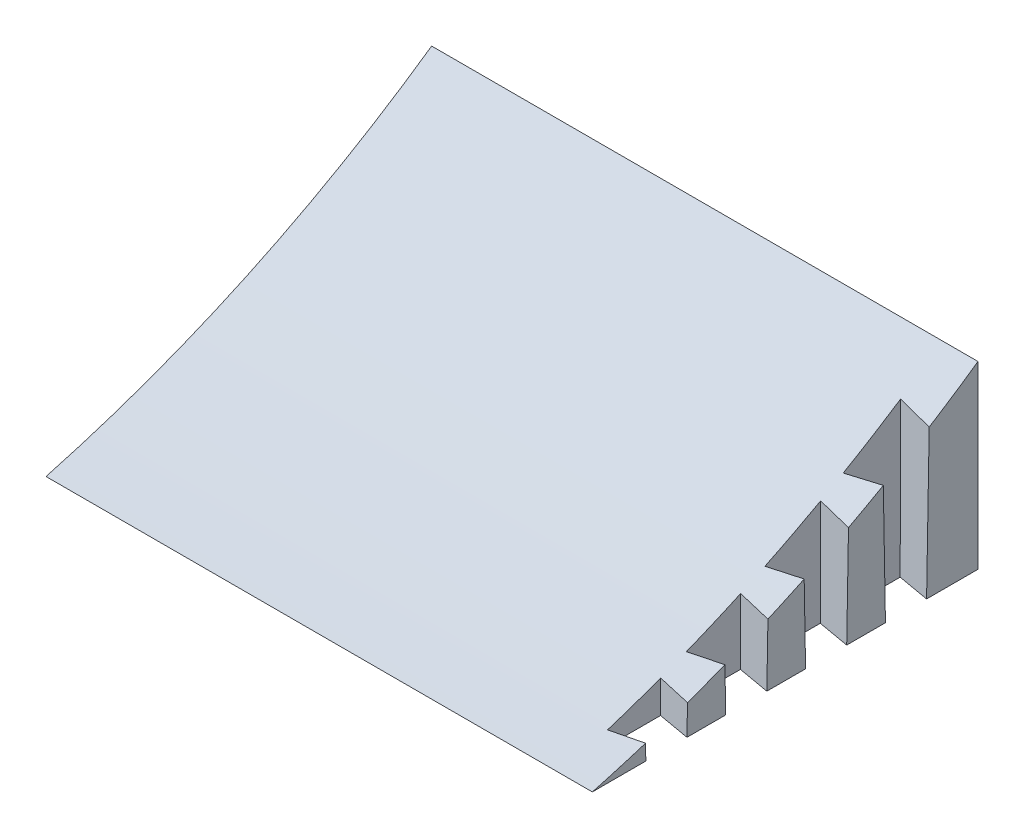
ISO-10303-21;
HEADER;
FILE_DESCRIPTION(('STEP AP214'),'2;1');
FILE_NAME('part.step','',(''),(''),'','','');
FILE_SCHEMA(('AUTOMOTIVE_DESIGN { 1 0 10303 214 1 1 1 1 }'));
ENDSEC;
DATA;
#1=APPLICATION_CONTEXT('core data for automotive mechanical design processes');
#2=APPLICATION_PROTOCOL_DEFINITION('international standard','automotive_design',2000,#1);
#3=PRODUCT_CONTEXT('',#1,'mechanical');
#4=PRODUCT('Part','Part','',(#3));
#5=PRODUCT_RELATED_PRODUCT_CATEGORY('part','',(#4));
#6=PRODUCT_DEFINITION_FORMATION('','',#4);
#7=PRODUCT_DEFINITION_CONTEXT('part definition',#1,'design');
#8=PRODUCT_DEFINITION('design','',#6,#7);
#9=PRODUCT_DEFINITION_SHAPE('','',#8);
#10=(LENGTH_UNIT() NAMED_UNIT(*) SI_UNIT(.MILLI.,.METRE.));
#11=(NAMED_UNIT(*) PLANE_ANGLE_UNIT() SI_UNIT($,.RADIAN.));
#12=(NAMED_UNIT(*) SI_UNIT($,.STERADIAN.) SOLID_ANGLE_UNIT());
#13=UNCERTAINTY_MEASURE_WITH_UNIT(LENGTH_MEASURE(1.E-05),#10,'distance_accuracy_value','');
#14=(GEOMETRIC_REPRESENTATION_CONTEXT(3) GLOBAL_UNCERTAINTY_ASSIGNED_CONTEXT((#13)) GLOBAL_UNIT_ASSIGNED_CONTEXT((#10,
#11,#12)) REPRESENTATION_CONTEXT('',''));
#15=CARTESIAN_POINT('',(0.,0.,0.));
#16=DIRECTION('',(0.,0.,1.));
#17=DIRECTION('',(1.,0.,0.));
#18=AXIS2_PLACEMENT_3D('',#15,#16,#17);
#19=CARTESIAN_POINT('',(134.9375,294.29273435255,79.3399426978569));
#20=DIRECTION('',(1.,0.,0.));
#21=DIRECTION('',(0.,0.,-1.));
#22=AXIS2_PLACEMENT_3D('',#19,#20,#21);
#23=PLANE('',#22);
#24=DIRECTION('',(0.,0.999842960930802,-0.0177215540268519));
#25=VECTOR('',#24,1.);
#26=CARTESIAN_POINT('',(134.9375,291.331819865992,-87.7136634824032));
#27=LINE('',#26,#25);
#28=CARTESIAN_POINT('',(134.9375,0.,-82.55));
#29=VERTEX_POINT('',#28);
#30=CARTESIAN_POINT('',(134.9375,36.4456567668093,-83.1959751187685));
#31=VERTEX_POINT('',#30);
#32=EDGE_CURVE('E11',#29,#31,#27,.T.);
#33=ORIENTED_EDGE('',*,*,#32,.F.);
#34=DIRECTION('',(0.,0.,-1.));
#35=VECTOR('',#34,1.);
#36=CARTESIAN_POINT('',(134.9375,0.,0.));
#37=LINE('',#36,#35);
#38=CARTESIAN_POINT('',(134.9375,0.,-95.25));
#39=VERTEX_POINT('',#38);
#40=EDGE_CURVE('E217',#29,#39,#37,.T.);
#41=ORIENTED_EDGE('',*,*,#40,.T.);
#42=DIRECTION('',(0.,1.,0.));
#43=VECTOR('',#42,1.);
#44=CARTESIAN_POINT('',(134.9375,0.,-95.25));
#45=LINE('',#44,#43);
#46=CARTESIAN_POINT('',(134.9375,44.45,-95.25));
#47=VERTEX_POINT('',#46);
#48=EDGE_CURVE('E226',#39,#47,#45,.T.);
#49=ORIENTED_EDGE('',*,*,#48,.T.);
#50=CARTESIAN_POINT('',(134.9375,294.29273435255,79.3399426978569));
#51=DIRECTION('',(-1.,0.,0.));
#52=DIRECTION('',(0.,0.,-1.));
#53=AXIS2_PLACEMENT_3D('',#50,#51,#52);
#54=CIRCLE('',#53,304.8);
#55=EDGE_CURVE('E221',#47,#31,#54,.T.);
#56=ORIENTED_EDGE('',*,*,#55,.T.);
#57=EDGE_LOOP('',(#33,#41,#49,#56));
#58=FACE_BOUND('',#57,.T.);
#59=ADVANCED_FACE('F35',(#58),#23,.T.);
#60=DIRECTION('',(0.,-0.999842960930802,-0.0177215540268519));
#61=VECTOR('',#60,1.);
#62=CARTESIAN_POINT('',(134.9375,296.888778812203,-67.1278431020922));
#63=LINE('',#62,#61);
#64=CARTESIAN_POINT('',(134.9375,29.6416063292887,-71.864622167147));
#65=VERTEX_POINT('',#64);
#66=CARTESIAN_POINT('',(134.9375,0.,-72.39));
#67=VERTEX_POINT('',#66);
#68=EDGE_CURVE('E43',#65,#67,#63,.T.);
#69=ORIENTED_EDGE('',*,*,#68,.F.);
#70=CARTESIAN_POINT('',(134.9375,24.9099125980556,-63.2641783631631));
#71=VERTEX_POINT('',#70);
#72=EDGE_CURVE('E268',#65,#71,#54,.T.);
#73=ORIENTED_EDGE('',*,*,#72,.T.);
#74=DIRECTION('',(0.,0.999842960930802,-0.0177215540268519));
#75=VECTOR('',#74,1.);
#76=CARTESIAN_POINT('',(134.9375,291.681363968762,-67.9925255866976));
#77=LINE('',#76,#75);
#78=CARTESIAN_POINT('',(134.9375,0.,-62.8226666666667));
#79=VERTEX_POINT('',#78);
#80=EDGE_CURVE('E202',#79,#71,#77,.T.);
#81=ORIENTED_EDGE('',*,*,#80,.F.);
#82=EDGE_CURVE('E208',#79,#67,#37,.T.);
#83=ORIENTED_EDGE('',*,*,#82,.T.);
#84=EDGE_LOOP('',(#69,#73,#81,#83));
#85=FACE_BOUND('',#84,.T.);
#86=ADVANCED_FACE('F215',(#85),#23,.T.);
#87=DIRECTION('',(0.,-0.999842960930802,-0.0177215540268519));
#88=VECTOR('',#87,1.);
#89=CARTESIAN_POINT('',(134.9375,296.539234709433,-47.4067052063867));
#90=LINE('',#89,#88);
#91=CARTESIAN_POINT('',(134.9375,19.3945960777428,-52.3189103012663));
#92=VERTEX_POINT('',#91);
#93=CARTESIAN_POINT('',(134.9375,0.,-52.6626666666667));
#94=VERTEX_POINT('',#93);
#95=EDGE_CURVE('E257',#92,#94,#90,.T.);
#96=ORIENTED_EDGE('',*,*,#95,.F.);
#97=CARTESIAN_POINT('',(134.9375,15.2833483105824,-43.3662205560078));
#98=VERTEX_POINT('',#97);
#99=EDGE_CURVE('E273',#92,#98,#54,.T.);
#100=ORIENTED_EDGE('',*,*,#99,.T.);
#101=DIRECTION('',(0.,0.999842960930802,-0.0177215540268519));
#102=VECTOR('',#101,1.);
#103=CARTESIAN_POINT('',(134.9375,292.030908071532,-48.2713876909921));
#104=LINE('',#103,#102);
#105=CARTESIAN_POINT('',(134.9375,0.,-43.0953333333333));
#106=VERTEX_POINT('',#105);
#107=EDGE_CURVE('E255',#106,#98,#104,.T.);
#108=ORIENTED_EDGE('',*,*,#107,.F.);
#109=EDGE_CURVE('E216',#106,#94,#37,.T.);
#110=ORIENTED_EDGE('',*,*,#109,.T.);
#111=EDGE_LOOP('',(#96,#100,#108,#110));
#112=FACE_BOUND('',#111,.T.);
#113=ADVANCED_FACE('F431',(#112),#23,.T.);
#114=DIRECTION('',(0.,-0.999842960930802,-0.0177215540268519));
#115=VECTOR('',#114,1.);
#116=CARTESIAN_POINT('',(134.9375,296.189690606663,-27.6855673106811));
#117=LINE('',#116,#115);
#118=CARTESIAN_POINT('',(134.9375,10.8488353393792,-32.7430449149439));
#119=VERTEX_POINT('',#118);
#120=CARTESIAN_POINT('',(134.9375,0.,-32.9353333333333));
#121=VERTEX_POINT('',#120);
#122=EDGE_CURVE('E253',#119,#121,#117,.T.);
#123=ORIENTED_EDGE('',*,*,#122,.F.);
#124=CARTESIAN_POINT('',(134.9375,7.36541776200195,-23.4985471498026));
#125=VERTEX_POINT('',#124);
#126=EDGE_CURVE('E276',#119,#125,#54,.T.);
#127=ORIENTED_EDGE('',*,*,#126,.T.);
#128=DIRECTION('',(0.,0.999842960930802,-0.0177215540268519));
#129=VECTOR('',#128,1.);
#130=CARTESIAN_POINT('',(134.9375,292.380452174302,-28.5502497952865));
#131=LINE('',#130,#129);
#132=CARTESIAN_POINT('',(134.9375,0.,-23.368));
#133=VERTEX_POINT('',#132);
#134=EDGE_CURVE('E251',#133,#125,#131,.T.);
#135=ORIENTED_EDGE('',*,*,#134,.F.);
#136=EDGE_CURVE('E220',#133,#121,#37,.T.);
#137=ORIENTED_EDGE('',*,*,#136,.T.);
#138=EDGE_LOOP('',(#123,#127,#135,#137));
#139=FACE_BOUND('',#138,.T.);
#140=ADVANCED_FACE('F434',(#139),#23,.T.);
#141=CARTESIAN_POINT('',(134.9375,294.29273435255,79.3399426978569));
#142=DIRECTION('',(-1.,0.,0.));
#143=DIRECTION('',(0.,0.,1.));
#144=AXIS2_PLACEMENT_3D('',#141,#142,#143);
#145=CYLINDRICAL_SURFACE('',#144,304.8);
#146=CARTESIAN_POINT('',(121.877820511967,294.29273435255,79.3399426978569));
#147=DIRECTION('',(-0.999847695156391,-0.0174524064372835,0.));
#148=DIRECTION('',(-0.0174524064372835,0.999847695156391,0.));
#149=AXIS2_PLACEMENT_3D('',#146,#147,#148);
#150=ELLIPSE('',#149,304.846429587783,304.8);
#151=CARTESIAN_POINT('',(126.511897262519,28.8066551194369,-70.3937600327877));
#152=VERTEX_POINT('',#151);
#153=CARTESIAN_POINT('',(126.361619512473,37.4160616535716,-84.7253340157175));
#154=VERTEX_POINT('',#153);
#155=EDGE_CURVE('E372',#152,#154,#150,.F.);
#156=ORIENTED_EDGE('',*,*,#155,.T.);
#157=CARTESIAN_POINT('',(1082.64320990519,294.29273435255,79.3399426978569));
#158=DIRECTION('',(0.173621730208385,-0.0174524064372835,-0.984657762021401));
#159=DIRECTION('',(-0.984812416046552,-0.0030768468721234,-0.17359446481348));
#160=AXIS2_PLACEMENT_3D('',#157,#158,#159);
#161=ELLIPSE('',#160,1755.54062060188,304.8);
#162=EDGE_CURVE('E362',#154,#31,#161,.F.);
#163=ORIENTED_EDGE('',*,*,#162,.T.);
#164=ORIENTED_EDGE('',*,*,#55,.F.);
#165=DIRECTION('',(-1.,0.,0.));
#166=VECTOR('',#165,1.);
#167=CARTESIAN_POINT('',(134.9375,44.45,-95.25));
#168=LINE('',#167,#166);
#169=CARTESIAN_POINT('',(0.,44.45,-95.25));
#170=VERTEX_POINT('',#169);
#171=EDGE_CURVE('E229',#47,#170,#168,.T.);
#172=ORIENTED_EDGE('',*,*,#171,.T.);
#173=CARTESIAN_POINT('',(0.,294.29273435255,79.3399426978569));
#174=DIRECTION('',(-1.,0.,0.));
#175=DIRECTION('',(0.,0.,-1.));
#176=AXIS2_PLACEMENT_3D('',#173,#174,#175);
#177=CIRCLE('',#176,304.8);
#178=CARTESIAN_POINT('',(0.,0.,0.));
#179=VERTEX_POINT('',#178);
#180=EDGE_CURVE('E230',#170,#179,#177,.T.);
#181=ORIENTED_EDGE('',*,*,#180,.T.);
#182=DIRECTION('',(-1.,0.,0.));
#183=VECTOR('',#182,1.);
#184=CARTESIAN_POINT('',(134.9375,0.,0.));
#185=LINE('',#184,#183);
#186=CARTESIAN_POINT('',(134.9375,0.,0.));
#187=VERTEX_POINT('',#186);
#188=EDGE_CURVE('E246',#187,#179,#185,.T.);
#189=ORIENTED_EDGE('',*,*,#188,.F.);
#190=CARTESIAN_POINT('',(134.9375,3.86102038828029,-13.1395659717742));
#191=VERTEX_POINT('',#190);
#192=EDGE_CURVE('E240',#191,#187,#54,.T.);
#193=ORIENTED_EDGE('',*,*,#192,.F.);
#194=CARTESIAN_POINT('',(-360.345743761525,294.29273435255,79.3399426978569));
#195=DIRECTION('',(0.173621730208383,-0.0174524064372835,0.984657762021402));
#196=DIRECTION('',(-0.984812416046552,-0.00307684687212337,0.173594464813479));
#197=AXIS2_PLACEMENT_3D('',#194,#195,#196);
#198=ELLIPSE('',#197,1755.54062060189,304.8);
#199=CARTESIAN_POINT('',(126.955039745881,3.41903925068536,-11.7398766793651));
#200=VERTEX_POINT('',#199);
#201=EDGE_CURVE('E50',#191,#200,#198,.F.);
#202=ORIENTED_EDGE('',*,*,#201,.T.);
#203=CARTESIAN_POINT('',(121.877820511967,294.29273435255,79.3399426978569));
#204=DIRECTION('',(-0.999847695156391,-0.0174524064372835,0.));
#205=DIRECTION('',(-0.0174524064372835,0.999847695156391,0.));
#206=AXIS2_PLACEMENT_3D('',#203,#204,#205);
#207=ELLIPSE('',#206,304.846429587783,304.8);
#208=CARTESIAN_POINT('',(126.877136224637,7.88212899362856,-24.9289651219526));
#209=VERTEX_POINT('',#208);
#210=EDGE_CURVE('E365',#200,#209,#207,.F.);
#211=ORIENTED_EDGE('',*,*,#210,.T.);
#212=CARTESIAN_POINT('',(747.00540925657,294.29273435255,79.3399426978569));
#213=DIRECTION('',(0.173621730208385,-0.0174524064372835,-0.984657762021401));
#214=DIRECTION('',(-0.984812416046552,-0.0030768468721234,-0.17359446481348));
#215=AXIS2_PLACEMENT_3D('',#212,#213,#214);
#216=ELLIPSE('',#215,1755.54062060188,304.8);
#217=EDGE_CURVE('E353',#209,#125,#216,.F.);
#218=ORIENTED_EDGE('',*,*,#217,.T.);
#219=ORIENTED_EDGE('',*,*,#126,.F.);
#220=CARTESIAN_POINT('',(-472.2250106444,294.29273435255,79.3399426978569));
#221=DIRECTION('',(0.173621730208383,-0.0174524064372835,0.984657762021402));
#222=DIRECTION('',(-0.984812416046552,-0.00307684687212337,0.173594464813479));
#223=AXIS2_PLACEMENT_3D('',#220,#221,#222);
#224=ELLIPSE('',#223,1755.5406206019,304.8);
#225=CARTESIAN_POINT('',(126.835073661376,10.2918916289684,-31.3242400005002));
#226=VERTEX_POINT('',#225);
#227=EDGE_CURVE('E58',#119,#226,#224,.F.);
#228=ORIENTED_EDGE('',*,*,#227,.T.);
#229=CARTESIAN_POINT('',(121.877820511967,294.29273435255,79.3399426978569));
#230=DIRECTION('',(-0.999847695156391,-0.0174524064372835,0.));
#231=DIRECTION('',(-0.0174524064372835,0.999847695156391,0.));
#232=AXIS2_PLACEMENT_3D('',#229,#230,#231);
#233=ELLIPSE('',#232,304.846429587783,304.8);
#234=CARTESIAN_POINT('',(126.736679580615,15.928884740479,-44.8236881654038));
#235=VERTEX_POINT('',#234);
#236=EDGE_CURVE('E368',#226,#235,#233,.F.);
#237=ORIENTED_EDGE('',*,*,#236,.T.);
#238=CARTESIAN_POINT('',(858.884676139444,294.29273435255,79.3399426978569));
#239=DIRECTION('',(0.173621730208385,-0.0174524064372835,-0.984657762021401));
#240=DIRECTION('',(-0.984812416046552,-0.0030768468721234,-0.17359446481348));
#241=AXIS2_PLACEMENT_3D('',#238,#239,#240);
#242=ELLIPSE('',#241,1755.54062060188,304.8);
#243=EDGE_CURVE('E357',#235,#98,#242,.F.);
#244=ORIENTED_EDGE('',*,*,#243,.T.);
#245=ORIENTED_EDGE('',*,*,#99,.F.);
#246=CARTESIAN_POINT('',(-584.104277527275,294.29273435255,79.3399426978569));
#247=DIRECTION('',(0.173621730208383,-0.0174524064372835,0.984657762021402));
#248=DIRECTION('',(-0.984812416046552,-0.00307684687212337,0.173594464813479));
#249=AXIS2_PLACEMENT_3D('',#246,#247,#248);
#250=ELLIPSE('',#249,1755.5406206019,304.8);
#251=CARTESIAN_POINT('',(126.688162798197,18.7084093436497,-50.8764917848485));
#252=VERTEX_POINT('',#251);
#253=EDGE_CURVE('E271',#92,#252,#250,.F.);
#254=ORIENTED_EDGE('',*,*,#253,.T.);
#255=CARTESIAN_POINT('',(121.877820511967,294.29273435255,79.3399426978569));
#256=DIRECTION('',(-0.999847695156391,-0.0174524064372835,0.));
#257=DIRECTION('',(-0.0174524064372835,0.999847695156391,0.));
#258=AXIS2_PLACEMENT_3D('',#255,#256,#257);
#259=ELLIPSE('',#258,304.846429587783,304.8);
#260=CARTESIAN_POINT('',(126.566053071268,25.704070914168,-64.7543662542434));
#261=VERTEX_POINT('',#260);
#262=EDGE_CURVE('E270',#252,#261,#259,.F.);
#263=ORIENTED_EDGE('',*,*,#262,.T.);
#264=CARTESIAN_POINT('',(970.763943022317,294.29273435255,79.3399426978569));
#265=DIRECTION('',(0.173621730208385,-0.0174524064372835,-0.984657762021401));
#266=DIRECTION('',(-0.984812416046552,-0.0030768468721234,-0.17359446481348));
#267=AXIS2_PLACEMENT_3D('',#264,#265,#266);
#268=ELLIPSE('',#267,1755.54062060188,304.8);
#269=EDGE_CURVE('E262',#261,#71,#268,.F.);
#270=ORIENTED_EDGE('',*,*,#269,.T.);
#271=ORIENTED_EDGE('',*,*,#72,.F.);
#272=CARTESIAN_POINT('',(-695.98354441015,294.29273435255,79.3399426978569));
#273=DIRECTION('',(0.173621730208383,-0.0174524064372835,0.984657762021402));
#274=DIRECTION('',(-0.984812416046552,-0.00307684687212337,0.173594464813479));
#275=AXIS2_PLACEMENT_3D('',#272,#273,#274);
#276=ELLIPSE('',#275,1755.5406206019,304.8);
#277=EDGE_CURVE('E197',#65,#152,#276,.F.);
#278=ORIENTED_EDGE('',*,*,#277,.T.);
#279=EDGE_LOOP('',(#156,#163,#164,#172,#181,#189,#193,#202,#211,#218,#219,#228,#237,#244,#245,
#254,#263,#270,#271,#278));
#280=FACE_BOUND('',#279,.T.);
#281=ADVANCED_FACE('F37',(#280),#145,.F.);
#282=CARTESIAN_POINT('',(134.9375,0.,0.));
#283=DIRECTION('',(0.,1.,0.));
#284=DIRECTION('',(0.,0.,1.));
#285=AXIS2_PLACEMENT_3D('',#282,#283,#284);
#286=PLANE('',#285);
#287=ORIENTED_EDGE('',*,*,#40,.F.);
#288=DIRECTION('',(0.984807753012209,0.,0.173648177666927));
#289=VECTOR('',#288,1.);
#290=CARTESIAN_POINT('',(134.9375,0.,-82.55));
#291=LINE('',#290,#289);
#292=CARTESIAN_POINT('',(127.014719297994,0.,-83.947));
#293=VERTEX_POINT('',#292);
#294=EDGE_CURVE('E311',#293,#29,#291,.T.);
#295=ORIENTED_EDGE('',*,*,#294,.F.);
#296=DIRECTION('',(0.,0.,-1.));
#297=VECTOR('',#296,1.);
#298=CARTESIAN_POINT('',(127.014719297994,0.,-83.947));
#299=LINE('',#298,#297);
#300=CARTESIAN_POINT('',(127.014719297994,0.,-70.993));
#301=VERTEX_POINT('',#300);
#302=EDGE_CURVE('E211',#301,#293,#299,.T.);
#303=ORIENTED_EDGE('',*,*,#302,.F.);
#304=DIRECTION('',(-0.984807753012209,0.,0.173648177666926));
#305=VECTOR('',#304,1.);
#306=CARTESIAN_POINT('',(127.014719297994,0.,-70.993));
#307=LINE('',#306,#305);
#308=EDGE_CURVE('E194',#67,#301,#307,.T.);
#309=ORIENTED_EDGE('',*,*,#308,.F.);
#310=ORIENTED_EDGE('',*,*,#82,.F.);
#311=DIRECTION('',(0.984807753012209,0.,0.173648177666927));
#312=VECTOR('',#311,1.);
#313=CARTESIAN_POINT('',(134.9375,0.,-62.8226666666667));
#314=LINE('',#313,#312);
#315=CARTESIAN_POINT('',(127.014719297994,0.,-64.2196666666667));
#316=VERTEX_POINT('',#315);
#317=EDGE_CURVE('E264',#316,#79,#314,.T.);
#318=ORIENTED_EDGE('',*,*,#317,.F.);
#319=DIRECTION('',(0.,0.,-1.));
#320=VECTOR('',#319,1.);
#321=CARTESIAN_POINT('',(127.014719297994,0.,-64.2196666666667));
#322=LINE('',#321,#320);
#323=CARTESIAN_POINT('',(127.014719297994,0.,-51.2656666666667));
#324=VERTEX_POINT('',#323);
#325=EDGE_CURVE('E323',#324,#316,#322,.T.);
#326=ORIENTED_EDGE('',*,*,#325,.F.);
#327=DIRECTION('',(-0.984807753012209,0.,0.173648177666926));
#328=VECTOR('',#327,1.);
#329=CARTESIAN_POINT('',(127.014719297994,0.,-51.2656666666667));
#330=LINE('',#329,#328);
#331=EDGE_CURVE('E320',#94,#324,#330,.T.);
#332=ORIENTED_EDGE('',*,*,#331,.F.);
#333=ORIENTED_EDGE('',*,*,#109,.F.);
#334=DIRECTION('',(0.984807753012209,0.,0.173648177666927));
#335=VECTOR('',#334,1.);
#336=CARTESIAN_POINT('',(134.9375,0.,-43.0953333333333));
#337=LINE('',#336,#335);
#338=CARTESIAN_POINT('',(127.014719297994,0.,-44.4923333333333));
#339=VERTEX_POINT('',#338);
#340=EDGE_CURVE('E338',#339,#106,#337,.T.);
#341=ORIENTED_EDGE('',*,*,#340,.F.);
#342=DIRECTION('',(0.,0.,-1.));
#343=VECTOR('',#342,1.);
#344=CARTESIAN_POINT('',(127.014719297994,0.,-44.4923333333333));
#345=LINE('',#344,#343);
#346=CARTESIAN_POINT('',(127.014719297994,0.,-31.5383333333333));
#347=VERTEX_POINT('',#346);
#348=EDGE_CURVE('E334',#347,#339,#345,.T.);
#349=ORIENTED_EDGE('',*,*,#348,.F.);
#350=DIRECTION('',(-0.984807753012209,0.,0.173648177666926));
#351=VECTOR('',#350,1.);
#352=CARTESIAN_POINT('',(127.014719297994,0.,-31.5383333333333));
#353=LINE('',#352,#351);
#354=EDGE_CURVE('E331',#121,#347,#353,.T.);
#355=ORIENTED_EDGE('',*,*,#354,.F.);
#356=ORIENTED_EDGE('',*,*,#136,.F.);
#357=DIRECTION('',(0.984807753012209,0.,0.173648177666927));
#358=VECTOR('',#357,1.);
#359=CARTESIAN_POINT('',(134.9375,0.,-23.368));
#360=LINE('',#359,#358);
#361=CARTESIAN_POINT('',(127.014719297994,0.,-24.765));
#362=VERTEX_POINT('',#361);
#363=EDGE_CURVE('E347',#362,#133,#360,.T.);
#364=ORIENTED_EDGE('',*,*,#363,.F.);
#365=DIRECTION('',(0.,0.,-1.));
#366=VECTOR('',#365,1.);
#367=CARTESIAN_POINT('',(127.014719297994,0.,-24.765));
#368=LINE('',#367,#366);
#369=CARTESIAN_POINT('',(127.014719297994,0.,-11.811));
#370=VERTEX_POINT('',#369);
#371=EDGE_CURVE('E344',#370,#362,#368,.T.);
#372=ORIENTED_EDGE('',*,*,#371,.F.);
#373=DIRECTION('',(-0.984807753012209,0.,0.173648177666926));
#374=VECTOR('',#373,1.);
#375=CARTESIAN_POINT('',(127.014719297994,0.,-11.811));
#376=LINE('',#375,#374);
#377=CARTESIAN_POINT('',(134.9375,0.,-13.208));
#378=VERTEX_POINT('',#377);
#379=EDGE_CURVE('E293',#378,#370,#376,.T.);
#380=ORIENTED_EDGE('',*,*,#379,.F.);
#381=EDGE_CURVE('E222',#187,#378,#37,.T.);
#382=ORIENTED_EDGE('',*,*,#381,.F.);
#383=ORIENTED_EDGE('',*,*,#188,.T.);
#384=DIRECTION('',(0.,0.,-1.));
#385=VECTOR('',#384,1.);
#386=CARTESIAN_POINT('',(0.,0.,0.));
#387=LINE('',#386,#385);
#388=CARTESIAN_POINT('',(0.,0.,-95.25));
#389=VERTEX_POINT('',#388);
#390=EDGE_CURVE('E233',#179,#389,#387,.T.);
#391=ORIENTED_EDGE('',*,*,#390,.T.);
#392=DIRECTION('',(-1.,0.,0.));
#393=VECTOR('',#392,1.);
#394=CARTESIAN_POINT('',(134.9375,0.,-95.25));
#395=LINE('',#394,#393);
#396=EDGE_CURVE('E243',#39,#389,#395,.T.);
#397=ORIENTED_EDGE('',*,*,#396,.F.);
#398=EDGE_LOOP('',(#287,#295,#303,#309,#310,#318,#326,#332,#333,#341,#349,#355,#356,#364,#372,
#380,#382,#383,#391,#397));
#399=FACE_BOUND('',#398,.T.);
#400=ADVANCED_FACE('F206',(#399),#286,.F.);
#401=CARTESIAN_POINT('',(134.9375,0.,-95.25));
#402=DIRECTION('',(0.,0.,1.));
#403=DIRECTION('',(1.,0.,0.));
#404=AXIS2_PLACEMENT_3D('',#401,#402,#403);
#405=PLANE('',#404);
#406=DIRECTION('',(0.,-1.,0.));
#407=VECTOR('',#406,1.);
#408=CARTESIAN_POINT('',(6.35,26.67,-95.25));
#409=LINE('',#408,#407);
#410=CARTESIAN_POINT('',(6.35,26.67,-95.25));
#411=VERTEX_POINT('',#410);
#412=CARTESIAN_POINT('',(6.35,7.62,-95.25));
#413=VERTEX_POINT('',#412);
#414=EDGE_CURVE('E381',#411,#413,#409,.T.);
#415=ORIENTED_EDGE('',*,*,#414,.F.);
#416=DIRECTION('',(-1.,0.,0.));
#417=VECTOR('',#416,1.);
#418=CARTESIAN_POINT('',(6.35,26.67,-95.25));
#419=LINE('',#418,#417);
#420=CARTESIAN_POINT('',(0.,26.67,-95.25));
#421=VERTEX_POINT('',#420);
#422=EDGE_CURVE('E234',#411,#421,#419,.T.);
#423=ORIENTED_EDGE('',*,*,#422,.T.);
#424=DIRECTION('',(0.,1.,0.));
#425=VECTOR('',#424,1.);
#426=CARTESIAN_POINT('',(0.,0.,-95.25));
#427=LINE('',#426,#425);
#428=EDGE_CURVE('E236',#421,#170,#427,.T.);
#429=ORIENTED_EDGE('',*,*,#428,.T.);
#430=ORIENTED_EDGE('',*,*,#171,.F.);
#431=ORIENTED_EDGE('',*,*,#48,.F.);
#432=ORIENTED_EDGE('',*,*,#396,.T.);
#433=CARTESIAN_POINT('',(0.,7.62,-95.25));
#434=VERTEX_POINT('',#433);
#435=EDGE_CURVE('E237',#389,#434,#427,.T.);
#436=ORIENTED_EDGE('',*,*,#435,.T.);
#437=DIRECTION('',(-1.,0.,0.));
#438=VECTOR('',#437,1.);
#439=CARTESIAN_POINT('',(6.35,7.62,-95.25));
#440=LINE('',#439,#438);
#441=EDGE_CURVE('E394',#413,#434,#440,.T.);
#442=ORIENTED_EDGE('',*,*,#441,.F.);
#443=EDGE_LOOP('',(#415,#423,#429,#430,#431,#432,#436,#442));
#444=FACE_BOUND('',#443,.T.);
#445=ADVANCED_FACE('F307',(#444),#405,.F.);
#446=DIRECTION('',(0.,-0.999842960930802,-0.0177215540268519));
#447=VECTOR('',#446,1.);
#448=CARTESIAN_POINT('',(134.9375,295.840146503892,-7.96442941497553));
#449=LINE('',#448,#447);
#450=EDGE_CURVE('E249',#191,#378,#449,.T.);
#451=ORIENTED_EDGE('',*,*,#450,.F.);
#452=ORIENTED_EDGE('',*,*,#192,.T.);
#453=ORIENTED_EDGE('',*,*,#381,.T.);
#454=EDGE_LOOP('',(#451,#452,#453));
#455=FACE_BOUND('',#454,.T.);
#456=ADVANCED_FACE('F288',(#455),#23,.T.);
#457=CARTESIAN_POINT('',(0.,294.29273435255,79.3399426978569));
#458=DIRECTION('',(1.,0.,0.));
#459=DIRECTION('',(0.,0.,-1.));
#460=AXIS2_PLACEMENT_3D('',#457,#458,#459);
#461=PLANE('',#460);
#462=ORIENTED_EDGE('',*,*,#428,.F.);
#463=DIRECTION('',(0.,0.,-1.));
#464=VECTOR('',#463,1.);
#465=CARTESIAN_POINT('',(0.,26.67,-95.25));
#466=LINE('',#465,#464);
#467=CARTESIAN_POINT('',(0.,26.67,-69.85));
#468=VERTEX_POINT('',#467);
#469=EDGE_CURVE('E385',#468,#421,#466,.T.);
#470=ORIENTED_EDGE('',*,*,#469,.F.);
#471=DIRECTION('',(0.,1.,0.));
#472=VECTOR('',#471,1.);
#473=CARTESIAN_POINT('',(0.,26.67,-69.85));
#474=LINE('',#473,#472);
#475=CARTESIAN_POINT('',(0.,7.62,-69.85));
#476=VERTEX_POINT('',#475);
#477=EDGE_CURVE('E397',#476,#468,#474,.T.);
#478=ORIENTED_EDGE('',*,*,#477,.F.);
#479=DIRECTION('',(0.,0.,1.));
#480=VECTOR('',#479,1.);
#481=CARTESIAN_POINT('',(0.,7.62,-95.25));
#482=LINE('',#481,#480);
#483=EDGE_CURVE('E378',#434,#476,#482,.T.);
#484=ORIENTED_EDGE('',*,*,#483,.F.);
#485=ORIENTED_EDGE('',*,*,#435,.F.);
#486=ORIENTED_EDGE('',*,*,#390,.F.);
#487=ORIENTED_EDGE('',*,*,#180,.F.);
#488=EDGE_LOOP('',(#462,#470,#478,#484,#485,#486,#487));
#489=FACE_BOUND('',#488,.T.);
#490=ADVANCED_FACE('F299',(#489),#461,.F.);
#491=CARTESIAN_POINT('',(6.35,26.67,-95.25));
#492=DIRECTION('',(0.,1.,0.));
#493=DIRECTION('',(0.,0.,1.));
#494=AXIS2_PLACEMENT_3D('',#491,#492,#493);
#495=PLANE('',#494);
#496=ORIENTED_EDGE('',*,*,#469,.T.);
#497=ORIENTED_EDGE('',*,*,#422,.F.);
#498=DIRECTION('',(0.,0.,-1.));
#499=VECTOR('',#498,1.);
#500=CARTESIAN_POINT('',(6.35,26.67,-95.25));
#501=LINE('',#500,#499);
#502=CARTESIAN_POINT('',(6.35,26.67,-69.85));
#503=VERTEX_POINT('',#502);
#504=EDGE_CURVE('E391',#503,#411,#501,.T.);
#505=ORIENTED_EDGE('',*,*,#504,.F.);
#506=DIRECTION('',(-1.,0.,0.));
#507=VECTOR('',#506,1.);
#508=CARTESIAN_POINT('',(6.35,26.67,-69.85));
#509=LINE('',#508,#507);
#510=EDGE_CURVE('E403',#503,#468,#509,.T.);
#511=ORIENTED_EDGE('',*,*,#510,.T.);
#512=EDGE_LOOP('',(#496,#497,#505,#511));
#513=FACE_BOUND('',#512,.T.);
#514=ADVANCED_FACE('F416',(#513),#495,.F.);
#515=CARTESIAN_POINT('',(6.35,26.67,-69.85));
#516=DIRECTION('',(0.,0.,1.));
#517=DIRECTION('',(1.,0.,0.));
#518=AXIS2_PLACEMENT_3D('',#515,#516,#517);
#519=PLANE('',#518);
#520=ORIENTED_EDGE('',*,*,#477,.T.);
#521=ORIENTED_EDGE('',*,*,#510,.F.);
#522=DIRECTION('',(0.,1.,0.));
#523=VECTOR('',#522,1.);
#524=CARTESIAN_POINT('',(6.35,26.67,-69.85));
#525=LINE('',#524,#523);
#526=CARTESIAN_POINT('',(6.35,7.62,-69.85));
#527=VERTEX_POINT('',#526);
#528=EDGE_CURVE('E388',#527,#503,#525,.T.);
#529=ORIENTED_EDGE('',*,*,#528,.F.);
#530=DIRECTION('',(-1.,0.,0.));
#531=VECTOR('',#530,1.);
#532=CARTESIAN_POINT('',(6.35,7.62,-69.85));
#533=LINE('',#532,#531);
#534=EDGE_CURVE('E405',#527,#476,#533,.T.);
#535=ORIENTED_EDGE('',*,*,#534,.T.);
#536=EDGE_LOOP('',(#520,#521,#529,#535));
#537=FACE_BOUND('',#536,.T.);
#538=ADVANCED_FACE('F410',(#537),#519,.F.);
#539=CARTESIAN_POINT('',(6.35,7.62,-95.25));
#540=DIRECTION('',(0.,-1.,0.));
#541=DIRECTION('',(0.,0.,-1.));
#542=AXIS2_PLACEMENT_3D('',#539,#540,#541);
#543=PLANE('',#542);
#544=ORIENTED_EDGE('',*,*,#483,.T.);
#545=ORIENTED_EDGE('',*,*,#534,.F.);
#546=DIRECTION('',(0.,0.,1.));
#547=VECTOR('',#546,1.);
#548=CARTESIAN_POINT('',(6.35,7.62,-95.25));
#549=LINE('',#548,#547);
#550=EDGE_CURVE('E384',#413,#527,#549,.T.);
#551=ORIENTED_EDGE('',*,*,#550,.F.);
#552=ORIENTED_EDGE('',*,*,#441,.T.);
#553=EDGE_LOOP('',(#544,#545,#551,#552));
#554=FACE_BOUND('',#553,.T.);
#555=ADVANCED_FACE('F407',(#554),#543,.F.);
#556=CARTESIAN_POINT('',(6.35,0.,0.));
#557=DIRECTION('',(-1.,0.,0.));
#558=DIRECTION('',(0.,0.,1.));
#559=AXIS2_PLACEMENT_3D('',#556,#557,#558);
#560=PLANE('',#559);
#561=CARTESIAN_POINT('',(6.35,17.145,-82.55));
#562=DIRECTION('',(-1.,0.,0.));
#563=DIRECTION('',(0.,0.,1.));
#564=AXIS2_PLACEMENT_3D('',#561,#562,#563);
#565=CIRCLE('',#564,2.921);
#566=CARTESIAN_POINT('',(6.35,17.145,-79.629));
#567=VERTEX_POINT('',#566);
#568=EDGE_CURVE('E374',#567,#567,#565,.T.);
#569=ORIENTED_EDGE('',*,*,#568,.F.);
#570=EDGE_LOOP('',(#569));
#571=FACE_BOUND('',#570,.T.);
#572=ORIENTED_EDGE('',*,*,#414,.T.);
#573=ORIENTED_EDGE('',*,*,#550,.T.);
#574=ORIENTED_EDGE('',*,*,#528,.T.);
#575=ORIENTED_EDGE('',*,*,#504,.T.);
#576=EDGE_LOOP('',(#572,#573,#574,#575));
#577=FACE_BOUND('',#576,.T.);
#578=ADVANCED_FACE('F414',(#571,#577),#560,.T.);
#579=CARTESIAN_POINT('',(31.75,17.145,-82.55));
#580=DIRECTION('',(-1.,0.,0.));
#581=DIRECTION('',(0.,0.,1.));
#582=AXIS2_PLACEMENT_3D('',#579,#580,#581);
#583=CYLINDRICAL_SURFACE('',#582,2.921);
#584=CARTESIAN_POINT('',(31.75,17.145,-82.55));
#585=DIRECTION('',(-1.,0.,0.));
#586=DIRECTION('',(0.,0.,1.));
#587=AXIS2_PLACEMENT_3D('',#584,#585,#586);
#588=CIRCLE('',#587,2.921);
#589=CARTESIAN_POINT('',(31.75,17.145,-79.629));
#590=VERTEX_POINT('',#589);
#591=EDGE_CURVE('E375',#590,#590,#588,.T.);
#592=ORIENTED_EDGE('',*,*,#591,.F.);
#593=EDGE_LOOP('',(#592));
#594=FACE_BOUND('',#593,.T.);
#595=ORIENTED_EDGE('',*,*,#568,.T.);
#596=EDGE_LOOP('',(#595));
#597=FACE_BOUND('',#596,.T.);
#598=ADVANCED_FACE('F494',(#594,#597),#583,.F.);
#599=CARTESIAN_POINT('',(31.75,17.145,-82.55));
#600=DIRECTION('',(-1.,0.,0.));
#601=DIRECTION('',(0.,0.,1.));
#602=AXIS2_PLACEMENT_3D('',#599,#600,#601);
#603=PLANE('',#602);
#604=ORIENTED_EDGE('',*,*,#591,.T.);
#605=EDGE_LOOP('',(#604));
#606=FACE_BOUND('',#605,.T.);
#607=ADVANCED_FACE('F489',(#606),#603,.T.);
#608=CARTESIAN_POINT('',(127.014719297994,0.,-24.765));
#609=DIRECTION('',(-0.999847695156391,-0.0174524064372835,0.));
#610=DIRECTION('',(0.0174524064372835,-0.999847695156391,0.));
#611=AXIS2_PLACEMENT_3D('',#608,#609,#610);
#612=PLANE('',#611);
#613=DIRECTION('',(0.0174486327316407,-0.999631499704907,-0.0207944707437896));
#614=VECTOR('',#613,1.);
#615=CARTESIAN_POINT('',(127.014719297994,0.,-11.811));
#616=LINE('',#615,#614);
#617=EDGE_CURVE('E349',#200,#370,#616,.T.);
#618=ORIENTED_EDGE('',*,*,#617,.T.);
#619=ORIENTED_EDGE('',*,*,#371,.T.);
#620=DIRECTION('',(0.0174486327316407,-0.999631499704907,0.0207944707437897));
#621=VECTOR('',#620,1.);
#622=CARTESIAN_POINT('',(127.014719297994,0.,-24.765));
#623=LINE('',#622,#621);
#624=EDGE_CURVE('E335',#209,#362,#623,.T.);
#625=ORIENTED_EDGE('',*,*,#624,.F.);
#626=ORIENTED_EDGE('',*,*,#210,.F.);
#627=EDGE_LOOP('',(#618,#619,#625,#626));
#628=FACE_BOUND('',#627,.T.);
#629=ADVANCED_FACE('F451',(#628),#612,.F.);
#630=CARTESIAN_POINT('',(134.9375,0.,-23.368));
#631=DIRECTION('',(0.173621730208385,-0.0174524064372835,-0.984657762021401));
#632=DIRECTION('',(-0.984807753012209,0.,-0.173648177666927));
#633=AXIS2_PLACEMENT_3D('',#630,#631,#632);
#634=PLANE('',#633);
#635=ORIENTED_EDGE('',*,*,#624,.T.);
#636=ORIENTED_EDGE('',*,*,#363,.T.);
#637=ORIENTED_EDGE('',*,*,#134,.T.);
#638=ORIENTED_EDGE('',*,*,#217,.F.);
#639=EDGE_LOOP('',(#635,#636,#637,#638));
#640=FACE_BOUND('',#639,.T.);
#641=ADVANCED_FACE('F449',(#640),#634,.F.);
#642=CARTESIAN_POINT('',(127.014719297994,0.,-11.811));
#643=DIRECTION('',(0.173621730208383,-0.0174524064372835,0.984657762021402));
#644=DIRECTION('',(0.984807753012209,0.,-0.173648177666926));
#645=AXIS2_PLACEMENT_3D('',#642,#643,#644);
#646=PLANE('',#645);
#647=ORIENTED_EDGE('',*,*,#450,.T.);
#648=ORIENTED_EDGE('',*,*,#379,.T.);
#649=ORIENTED_EDGE('',*,*,#617,.F.);
#650=ORIENTED_EDGE('',*,*,#201,.F.);
#651=EDGE_LOOP('',(#647,#648,#649,#650));
#652=FACE_BOUND('',#651,.T.);
#653=ADVANCED_FACE('F482',(#652),#646,.F.);
#654=CARTESIAN_POINT('',(127.014719297994,0.,-44.4923333333333));
#655=DIRECTION('',(-0.999847695156391,-0.0174524064372835,0.));
#656=DIRECTION('',(0.0174524064372835,-0.999847695156391,0.));
#657=AXIS2_PLACEMENT_3D('',#654,#655,#656);
#658=PLANE('',#657);
#659=DIRECTION('',(0.0174486327316407,-0.999631499704907,-0.0207944707437896));
#660=VECTOR('',#659,1.);
#661=CARTESIAN_POINT('',(127.014719297994,0.,-31.5383333333333));
#662=LINE('',#661,#660);
#663=EDGE_CURVE('E340',#226,#347,#662,.T.);
#664=ORIENTED_EDGE('',*,*,#663,.T.);
#665=ORIENTED_EDGE('',*,*,#348,.T.);
#666=DIRECTION('',(0.0174486327316407,-0.999631499704907,0.0207944707437897));
#667=VECTOR('',#666,1.);
#668=CARTESIAN_POINT('',(127.014719297994,0.,-44.4923333333333));
#669=LINE('',#668,#667);
#670=EDGE_CURVE('E324',#235,#339,#669,.T.);
#671=ORIENTED_EDGE('',*,*,#670,.F.);
#672=ORIENTED_EDGE('',*,*,#236,.F.);
#673=EDGE_LOOP('',(#664,#665,#671,#672));
#674=FACE_BOUND('',#673,.T.);
#675=ADVANCED_FACE('F457',(#674),#658,.F.);
#676=CARTESIAN_POINT('',(134.9375,0.,-43.0953333333333));
#677=DIRECTION('',(0.173621730208385,-0.0174524064372835,-0.984657762021401));
#678=DIRECTION('',(-0.984807753012209,0.,-0.173648177666927));
#679=AXIS2_PLACEMENT_3D('',#676,#677,#678);
#680=PLANE('',#679);
#681=ORIENTED_EDGE('',*,*,#670,.T.);
#682=ORIENTED_EDGE('',*,*,#340,.T.);
#683=ORIENTED_EDGE('',*,*,#107,.T.);
#684=ORIENTED_EDGE('',*,*,#243,.F.);
#685=EDGE_LOOP('',(#681,#682,#683,#684));
#686=FACE_BOUND('',#685,.T.);
#687=ADVANCED_FACE('F460',(#686),#680,.F.);
#688=CARTESIAN_POINT('',(127.014719297994,0.,-31.5383333333333));
#689=DIRECTION('',(0.173621730208383,-0.0174524064372835,0.984657762021402));
#690=DIRECTION('',(0.984807753012209,0.,-0.173648177666926));
#691=AXIS2_PLACEMENT_3D('',#688,#689,#690);
#692=PLANE('',#691);
#693=ORIENTED_EDGE('',*,*,#122,.T.);
#694=ORIENTED_EDGE('',*,*,#354,.T.);
#695=ORIENTED_EDGE('',*,*,#663,.F.);
#696=ORIENTED_EDGE('',*,*,#227,.F.);
#697=EDGE_LOOP('',(#693,#694,#695,#696));
#698=FACE_BOUND('',#697,.T.);
#699=ADVANCED_FACE('F455',(#698),#692,.F.);
#700=CARTESIAN_POINT('',(127.014719297994,0.,-64.2196666666667));
#701=DIRECTION('',(-0.999847695156391,-0.0174524064372835,0.));
#702=DIRECTION('',(0.0174524064372835,-0.999847695156391,0.));
#703=AXIS2_PLACEMENT_3D('',#700,#701,#702);
#704=PLANE('',#703);
#705=DIRECTION('',(0.0174486327316407,-0.999631499704907,-0.0207944707437896));
#706=VECTOR('',#705,1.);
#707=CARTESIAN_POINT('',(127.014719297994,0.,-51.2656666666667));
#708=LINE('',#707,#706);
#709=EDGE_CURVE('E328',#252,#324,#708,.T.);
#710=ORIENTED_EDGE('',*,*,#709,.T.);
#711=ORIENTED_EDGE('',*,*,#325,.T.);
#712=DIRECTION('',(0.0174486327316407,-0.999631499704907,0.0207944707437897));
#713=VECTOR('',#712,1.);
#714=CARTESIAN_POINT('',(127.014719297994,0.,-64.2196666666667));
#715=LINE('',#714,#713);
#716=EDGE_CURVE('E212',#261,#316,#715,.T.);
#717=ORIENTED_EDGE('',*,*,#716,.F.);
#718=ORIENTED_EDGE('',*,*,#262,.F.);
#719=EDGE_LOOP('',(#710,#711,#717,#718));
#720=FACE_BOUND('',#719,.T.);
#721=ADVANCED_FACE('F468',(#720),#704,.F.);
#722=CARTESIAN_POINT('',(134.9375,0.,-62.8226666666667));
#723=DIRECTION('',(0.173621730208385,-0.0174524064372835,-0.984657762021401));
#724=DIRECTION('',(-0.984807753012209,0.,-0.173648177666927));
#725=AXIS2_PLACEMENT_3D('',#722,#723,#724);
#726=PLANE('',#725);
#727=ORIENTED_EDGE('',*,*,#716,.T.);
#728=ORIENTED_EDGE('',*,*,#317,.T.);
#729=ORIENTED_EDGE('',*,*,#80,.T.);
#730=ORIENTED_EDGE('',*,*,#269,.F.);
#731=EDGE_LOOP('',(#727,#728,#729,#730));
#732=FACE_BOUND('',#731,.T.);
#733=ADVANCED_FACE('F261',(#732),#726,.F.);
#734=CARTESIAN_POINT('',(127.014719297994,0.,-51.2656666666667));
#735=DIRECTION('',(0.173621730208383,-0.0174524064372835,0.984657762021402));
#736=DIRECTION('',(0.984807753012209,0.,-0.173648177666926));
#737=AXIS2_PLACEMENT_3D('',#734,#735,#736);
#738=PLANE('',#737);
#739=ORIENTED_EDGE('',*,*,#95,.T.);
#740=ORIENTED_EDGE('',*,*,#331,.T.);
#741=ORIENTED_EDGE('',*,*,#709,.F.);
#742=ORIENTED_EDGE('',*,*,#253,.F.);
#743=EDGE_LOOP('',(#739,#740,#741,#742));
#744=FACE_BOUND('',#743,.T.);
#745=ADVANCED_FACE('F466',(#744),#738,.F.);
#746=CARTESIAN_POINT('',(127.014719297994,0.,-83.947));
#747=DIRECTION('',(-0.999847695156391,-0.0174524064372835,0.));
#748=DIRECTION('',(0.0174524064372835,-0.999847695156391,0.));
#749=AXIS2_PLACEMENT_3D('',#746,#747,#748);
#750=PLANE('',#749);
#751=DIRECTION('',(0.0174486327316407,-0.999631499704907,-0.0207944707437896));
#752=VECTOR('',#751,1.);
#753=CARTESIAN_POINT('',(127.014719297994,0.,-70.993));
#754=LINE('',#753,#752);
#755=EDGE_CURVE('E313',#152,#301,#754,.T.);
#756=ORIENTED_EDGE('',*,*,#755,.T.);
#757=ORIENTED_EDGE('',*,*,#302,.T.);
#758=DIRECTION('',(0.0174486327316407,-0.999631499704907,0.0207944707437897));
#759=VECTOR('',#758,1.);
#760=CARTESIAN_POINT('',(127.014719297994,0.,-83.947));
#761=LINE('',#760,#759);
#762=EDGE_CURVE('E315',#154,#293,#761,.T.);
#763=ORIENTED_EDGE('',*,*,#762,.F.);
#764=ORIENTED_EDGE('',*,*,#155,.F.);
#765=EDGE_LOOP('',(#756,#757,#763,#764));
#766=FACE_BOUND('',#765,.T.);
#767=ADVANCED_FACE('F622',(#766),#750,.F.);
#768=CARTESIAN_POINT('',(134.9375,0.,-82.55));
#769=DIRECTION('',(0.173621730208385,-0.0174524064372835,-0.984657762021401));
#770=DIRECTION('',(-0.984807753012209,0.,-0.173648177666927));
#771=AXIS2_PLACEMENT_3D('',#768,#769,#770);
#772=PLANE('',#771);
#773=ORIENTED_EDGE('',*,*,#762,.T.);
#774=ORIENTED_EDGE('',*,*,#294,.T.);
#775=ORIENTED_EDGE('',*,*,#32,.T.);
#776=ORIENTED_EDGE('',*,*,#162,.F.);
#777=EDGE_LOOP('',(#773,#774,#775,#776));
#778=FACE_BOUND('',#777,.T.);
#779=ADVANCED_FACE('F630',(#778),#772,.F.);
#780=CARTESIAN_POINT('',(127.014719297994,0.,-70.993));
#781=DIRECTION('',(0.173621730208383,-0.0174524064372835,0.984657762021402));
#782=DIRECTION('',(0.984807753012209,0.,-0.173648177666926));
#783=AXIS2_PLACEMENT_3D('',#780,#781,#782);
#784=PLANE('',#783);
#785=ORIENTED_EDGE('',*,*,#68,.T.);
#786=ORIENTED_EDGE('',*,*,#308,.T.);
#787=ORIENTED_EDGE('',*,*,#755,.F.);
#788=ORIENTED_EDGE('',*,*,#277,.F.);
#789=EDGE_LOOP('',(#785,#786,#787,#788));
#790=FACE_BOUND('',#789,.T.);
#791=ADVANCED_FACE('F192',(#790),#784,.F.);
#792=CLOSED_SHELL('',(#59,#86,#113,#140,#281,#400,#445,#456,#490,#514,#538,#555,#578,#598,#607,
#629,#641,#653,#675,#687,#699,#721,#733,#745,#767,#779,#791));
#793=MANIFOLD_SOLID_BREP('B2',#792);
#794=ADVANCED_BREP_SHAPE_REPRESENTATION('',(#18,#793),#14);
#795=SHAPE_DEFINITION_REPRESENTATION(#9,#794);
ENDSEC;
END-ISO-10303-21;
